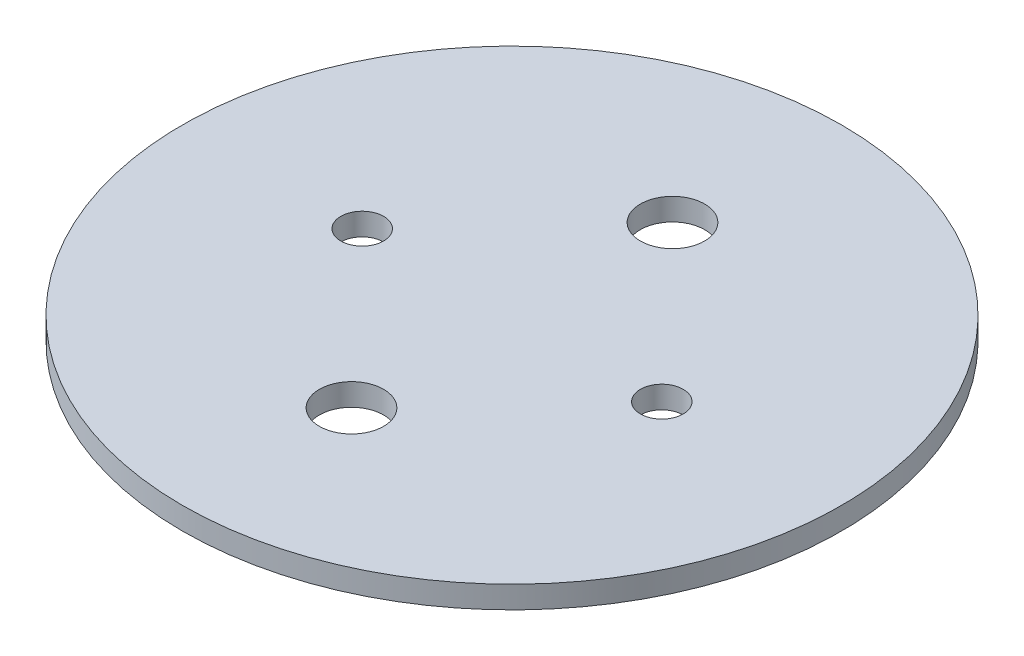
ISO-10303-21;
HEADER;
FILE_DESCRIPTION(('STEP AP214'),'2;1');
FILE_NAME('part.step','',(''),(''),'','','');
FILE_SCHEMA(('AUTOMOTIVE_DESIGN { 1 0 10303 214 1 1 1 1 }'));
ENDSEC;
DATA;
#1=APPLICATION_CONTEXT('core data for automotive mechanical design processes');
#2=APPLICATION_PROTOCOL_DEFINITION('international standard','automotive_design',2000,#1);
#3=PRODUCT_CONTEXT('',#1,'mechanical');
#4=PRODUCT('Part','Part','',(#3));
#5=PRODUCT_RELATED_PRODUCT_CATEGORY('part','',(#4));
#6=PRODUCT_DEFINITION_FORMATION('','',#4);
#7=PRODUCT_DEFINITION_CONTEXT('part definition',#1,'design');
#8=PRODUCT_DEFINITION('design','',#6,#7);
#9=PRODUCT_DEFINITION_SHAPE('','',#8);
#10=(LENGTH_UNIT() NAMED_UNIT(*) SI_UNIT(.MILLI.,.METRE.));
#11=(NAMED_UNIT(*) PLANE_ANGLE_UNIT() SI_UNIT($,.RADIAN.));
#12=(NAMED_UNIT(*) SI_UNIT($,.STERADIAN.) SOLID_ANGLE_UNIT());
#13=UNCERTAINTY_MEASURE_WITH_UNIT(LENGTH_MEASURE(1.E-05),#10,'distance_accuracy_value','');
#14=(GEOMETRIC_REPRESENTATION_CONTEXT(3) GLOBAL_UNCERTAINTY_ASSIGNED_CONTEXT((#13)) GLOBAL_UNIT_ASSIGNED_CONTEXT((#10,
#11,#12)) REPRESENTATION_CONTEXT('',''));
#15=CARTESIAN_POINT('',(0.,0.,0.));
#16=DIRECTION('',(0.,0.,1.));
#17=DIRECTION('',(1.,0.,0.));
#18=AXIS2_PLACEMENT_3D('',#15,#16,#17);
#19=CARTESIAN_POINT('',(0.,3.302,0.));
#20=DIRECTION('',(0.,1.,0.));
#21=DIRECTION('',(0.,0.,1.));
#22=AXIS2_PLACEMENT_3D('',#19,#20,#21);
#23=PLANE('',#22);
#24=CARTESIAN_POINT('',(0.,3.302,23.8125));
#25=DIRECTION('',(0.,1.,0.));
#26=DIRECTION('',(0.,0.,1.));
#27=AXIS2_PLACEMENT_3D('',#24,#25,#26);
#28=CIRCLE('',#27,4.7625);
#29=CARTESIAN_POINT('',(0.,3.302,28.575));
#30=VERTEX_POINT('',#29);
#31=EDGE_CURVE('E63',#30,#30,#28,.T.);
#32=ORIENTED_EDGE('',*,*,#31,.F.);
#33=EDGE_LOOP('',(#32));
#34=FACE_BOUND('',#33,.T.);
#35=CARTESIAN_POINT('',(22.225,3.302,0.));
#36=DIRECTION('',(0.,1.,0.));
#37=DIRECTION('',(0.,0.,1.));
#38=AXIS2_PLACEMENT_3D('',#35,#36,#37);
#39=CIRCLE('',#38,3.175);
#40=CARTESIAN_POINT('',(22.225,3.302,3.175));
#41=VERTEX_POINT('',#40);
#42=EDGE_CURVE('E52',#41,#41,#39,.T.);
#43=ORIENTED_EDGE('',*,*,#42,.F.);
#44=EDGE_LOOP('',(#43));
#45=FACE_BOUND('',#44,.T.);
#46=CARTESIAN_POINT('',(0.,3.302,0.));
#47=DIRECTION('',(0.,1.,0.));
#48=DIRECTION('',(0.,0.,1.));
#49=AXIS2_PLACEMENT_3D('',#46,#47,#48);
#50=CIRCLE('',#49,48.895);
#51=CARTESIAN_POINT('',(0.,3.302,48.895));
#52=VERTEX_POINT('',#51);
#53=EDGE_CURVE('E10',#52,#52,#50,.T.);
#54=ORIENTED_EDGE('',*,*,#53,.T.);
#55=EDGE_LOOP('',(#54));
#56=FACE_BOUND('',#55,.T.);
#57=CARTESIAN_POINT('',(-22.225,3.302,0.));
#58=DIRECTION('',(0.,1.,0.));
#59=DIRECTION('',(0.,0.,1.));
#60=AXIS2_PLACEMENT_3D('',#57,#58,#59);
#61=CIRCLE('',#60,3.175);
#62=CARTESIAN_POINT('',(-22.225,3.302,3.175));
#63=VERTEX_POINT('',#62);
#64=EDGE_CURVE('E57',#63,#63,#61,.T.);
#65=ORIENTED_EDGE('',*,*,#64,.F.);
#66=EDGE_LOOP('',(#65));
#67=FACE_BOUND('',#66,.T.);
#68=CARTESIAN_POINT('',(0.,3.302,-23.8125));
#69=DIRECTION('',(0.,1.,0.));
#70=DIRECTION('',(0.,0.,1.));
#71=AXIS2_PLACEMENT_3D('',#68,#69,#70);
#72=CIRCLE('',#71,4.7625);
#73=CARTESIAN_POINT('',(0.,3.302,-19.05));
#74=VERTEX_POINT('',#73);
#75=EDGE_CURVE('E69',#74,#74,#72,.T.);
#76=ORIENTED_EDGE('',*,*,#75,.F.);
#77=EDGE_LOOP('',(#76));
#78=FACE_BOUND('',#77,.T.);
#79=ADVANCED_FACE('F41',(#34,#45,#56,#67,#78),#23,.T.);
#80=CARTESIAN_POINT('',(0.,0.,0.));
#81=DIRECTION('',(0.,1.,0.));
#82=DIRECTION('',(0.,0.,1.));
#83=AXIS2_PLACEMENT_3D('',#80,#81,#82);
#84=PLANE('',#83);
#85=CARTESIAN_POINT('',(0.,0.,0.));
#86=DIRECTION('',(0.,1.,0.));
#87=DIRECTION('',(0.,0.,1.));
#88=AXIS2_PLACEMENT_3D('',#85,#86,#87);
#89=CIRCLE('',#88,48.895);
#90=CARTESIAN_POINT('',(0.,0.,48.895));
#91=VERTEX_POINT('',#90);
#92=EDGE_CURVE('E45',#91,#91,#89,.T.);
#93=ORIENTED_EDGE('',*,*,#92,.F.);
#94=EDGE_LOOP('',(#93));
#95=FACE_BOUND('',#94,.T.);
#96=CARTESIAN_POINT('',(22.225,0.,0.));
#97=DIRECTION('',(0.,1.,0.));
#98=DIRECTION('',(0.,0.,1.));
#99=AXIS2_PLACEMENT_3D('',#96,#97,#98);
#100=CIRCLE('',#99,3.175);
#101=CARTESIAN_POINT('',(22.225,0.,3.175));
#102=VERTEX_POINT('',#101);
#103=EDGE_CURVE('E54',#102,#102,#100,.T.);
#104=ORIENTED_EDGE('',*,*,#103,.T.);
#105=EDGE_LOOP('',(#104));
#106=FACE_BOUND('',#105,.T.);
#107=CARTESIAN_POINT('',(-22.225,0.,0.));
#108=DIRECTION('',(0.,1.,0.));
#109=DIRECTION('',(0.,0.,1.));
#110=AXIS2_PLACEMENT_3D('',#107,#108,#109);
#111=CIRCLE('',#110,3.175);
#112=CARTESIAN_POINT('',(-22.225,0.,3.175));
#113=VERTEX_POINT('',#112);
#114=EDGE_CURVE('E60',#113,#113,#111,.T.);
#115=ORIENTED_EDGE('',*,*,#114,.T.);
#116=EDGE_LOOP('',(#115));
#117=FACE_BOUND('',#116,.T.);
#118=CARTESIAN_POINT('',(0.,0.,23.8125));
#119=DIRECTION('',(0.,1.,0.));
#120=DIRECTION('',(0.,0.,1.));
#121=AXIS2_PLACEMENT_3D('',#118,#119,#120);
#122=CIRCLE('',#121,4.7625);
#123=CARTESIAN_POINT('',(0.,0.,28.575));
#124=VERTEX_POINT('',#123);
#125=EDGE_CURVE('E66',#124,#124,#122,.T.);
#126=ORIENTED_EDGE('',*,*,#125,.T.);
#127=EDGE_LOOP('',(#126));
#128=FACE_BOUND('',#127,.T.);
#129=CARTESIAN_POINT('',(0.,0.,-23.8125));
#130=DIRECTION('',(0.,1.,0.));
#131=DIRECTION('',(0.,0.,1.));
#132=AXIS2_PLACEMENT_3D('',#129,#130,#131);
#133=CIRCLE('',#132,4.7625);
#134=CARTESIAN_POINT('',(0.,0.,-19.05));
#135=VERTEX_POINT('',#134);
#136=EDGE_CURVE('E72',#135,#135,#133,.T.);
#137=ORIENTED_EDGE('',*,*,#136,.T.);
#138=EDGE_LOOP('',(#137));
#139=FACE_BOUND('',#138,.T.);
#140=ADVANCED_FACE('F82',(#95,#106,#117,#128,#139),#84,.F.);
#141=CARTESIAN_POINT('',(0.,3.302,0.));
#142=DIRECTION('',(0.,-1.,0.));
#143=DIRECTION('',(0.,0.,-1.));
#144=AXIS2_PLACEMENT_3D('',#141,#142,#143);
#145=CYLINDRICAL_SURFACE('',#144,48.895);
#146=ORIENTED_EDGE('',*,*,#53,.F.);
#147=EDGE_LOOP('',(#146));
#148=FACE_BOUND('',#147,.T.);
#149=ORIENTED_EDGE('',*,*,#92,.T.);
#150=EDGE_LOOP('',(#149));
#151=FACE_BOUND('',#150,.T.);
#152=ADVANCED_FACE('F43',(#148,#151),#145,.T.);
#153=CARTESIAN_POINT('',(22.225,3.302,0.));
#154=DIRECTION('',(0.,-1.,0.));
#155=DIRECTION('',(0.,0.,-1.));
#156=AXIS2_PLACEMENT_3D('',#153,#154,#155);
#157=CYLINDRICAL_SURFACE('',#156,3.175);
#158=ORIENTED_EDGE('',*,*,#42,.T.);
#159=EDGE_LOOP('',(#158));
#160=FACE_BOUND('',#159,.T.);
#161=ORIENTED_EDGE('',*,*,#103,.F.);
#162=EDGE_LOOP('',(#161));
#163=FACE_BOUND('',#162,.T.);
#164=ADVANCED_FACE('F92',(#160,#163),#157,.F.);
#165=CARTESIAN_POINT('',(-22.225,3.302,0.));
#166=DIRECTION('',(0.,-1.,0.));
#167=DIRECTION('',(0.,0.,-1.));
#168=AXIS2_PLACEMENT_3D('',#165,#166,#167);
#169=CYLINDRICAL_SURFACE('',#168,3.175);
#170=ORIENTED_EDGE('',*,*,#64,.T.);
#171=EDGE_LOOP('',(#170));
#172=FACE_BOUND('',#171,.T.);
#173=ORIENTED_EDGE('',*,*,#114,.F.);
#174=EDGE_LOOP('',(#173));
#175=FACE_BOUND('',#174,.T.);
#176=ADVANCED_FACE('F95',(#172,#175),#169,.F.);
#177=CARTESIAN_POINT('',(0.,3.302,23.8125));
#178=DIRECTION('',(0.,-1.,0.));
#179=DIRECTION('',(0.,0.,-1.));
#180=AXIS2_PLACEMENT_3D('',#177,#178,#179);
#181=CYLINDRICAL_SURFACE('',#180,4.7625);
#182=ORIENTED_EDGE('',*,*,#31,.T.);
#183=EDGE_LOOP('',(#182));
#184=FACE_BOUND('',#183,.T.);
#185=ORIENTED_EDGE('',*,*,#125,.F.);
#186=EDGE_LOOP('',(#185));
#187=FACE_BOUND('',#186,.T.);
#188=ADVANCED_FACE('F99',(#184,#187),#181,.F.);
#189=CARTESIAN_POINT('',(0.,3.302,-23.8125));
#190=DIRECTION('',(0.,-1.,0.));
#191=DIRECTION('',(0.,0.,-1.));
#192=AXIS2_PLACEMENT_3D('',#189,#190,#191);
#193=CYLINDRICAL_SURFACE('',#192,4.7625);
#194=ORIENTED_EDGE('',*,*,#75,.T.);
#195=EDGE_LOOP('',(#194));
#196=FACE_BOUND('',#195,.T.);
#197=ORIENTED_EDGE('',*,*,#136,.F.);
#198=EDGE_LOOP('',(#197));
#199=FACE_BOUND('',#198,.T.);
#200=ADVANCED_FACE('F78',(#196,#199),#193,.F.);
#201=CLOSED_SHELL('',(#79,#140,#152,#164,#176,#188,#200));
#202=MANIFOLD_SOLID_BREP('B2',#201);
#203=ADVANCED_BREP_SHAPE_REPRESENTATION('',(#18,#202),#14);
#204=SHAPE_DEFINITION_REPRESENTATION(#9,#203);
ENDSEC;
END-ISO-10303-21;
